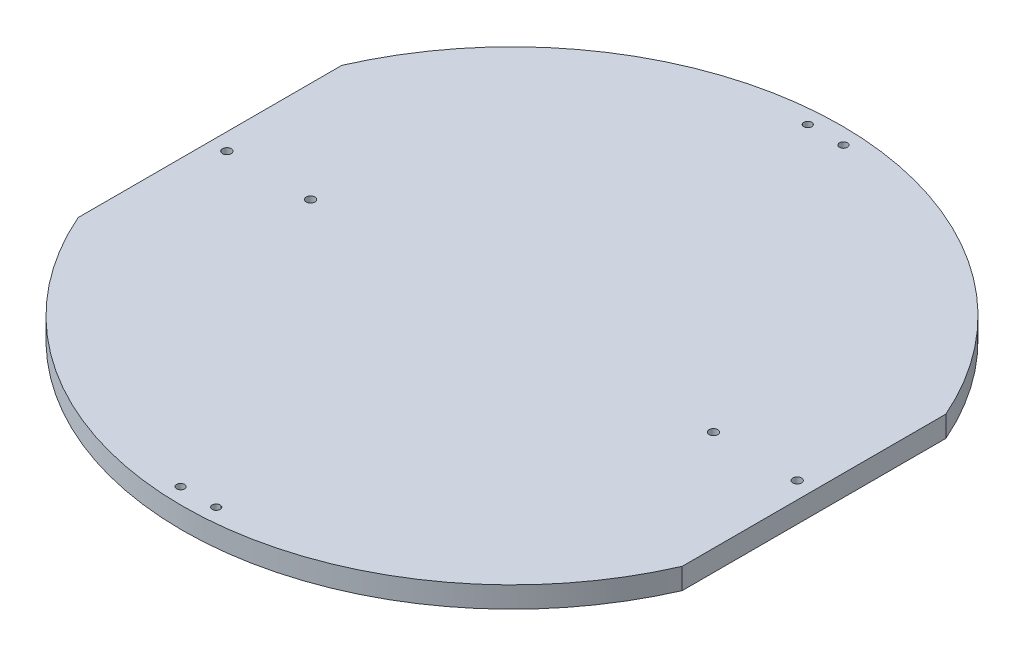
ISO-10303-21;
HEADER;
FILE_DESCRIPTION(('STEP AP214'),'2;1');
FILE_NAME('part.step','',(''),(''),'','','');
FILE_SCHEMA(('AUTOMOTIVE_DESIGN { 1 0 10303 214 1 1 1 1 }'));
ENDSEC;
DATA;
#1=APPLICATION_CONTEXT('core data for automotive mechanical design processes');
#2=APPLICATION_PROTOCOL_DEFINITION('international standard','automotive_design',2000,#1);
#3=PRODUCT_CONTEXT('',#1,'mechanical');
#4=PRODUCT('Part','Part','',(#3));
#5=PRODUCT_RELATED_PRODUCT_CATEGORY('part','',(#4));
#6=PRODUCT_DEFINITION_FORMATION('','',#4);
#7=PRODUCT_DEFINITION_CONTEXT('part definition',#1,'design');
#8=PRODUCT_DEFINITION('design','',#6,#7);
#9=PRODUCT_DEFINITION_SHAPE('','',#8);
#10=(LENGTH_UNIT() NAMED_UNIT(*) SI_UNIT(.MILLI.,.METRE.));
#11=(NAMED_UNIT(*) PLANE_ANGLE_UNIT() SI_UNIT($,.RADIAN.));
#12=(NAMED_UNIT(*) SI_UNIT($,.STERADIAN.) SOLID_ANGLE_UNIT());
#13=UNCERTAINTY_MEASURE_WITH_UNIT(LENGTH_MEASURE(1.E-05),#10,'distance_accuracy_value','');
#14=(GEOMETRIC_REPRESENTATION_CONTEXT(3) GLOBAL_UNCERTAINTY_ASSIGNED_CONTEXT((#13)) GLOBAL_UNIT_ASSIGNED_CONTEXT((#10,
#11,#12)) REPRESENTATION_CONTEXT('',''));
#15=CARTESIAN_POINT('',(0.,0.,0.));
#16=DIRECTION('',(0.,0.,1.));
#17=DIRECTION('',(1.,0.,0.));
#18=AXIS2_PLACEMENT_3D('',#15,#16,#17);
#19=CARTESIAN_POINT('',(0.,8.,0.));
#20=DIRECTION('',(0.,1.,0.));
#21=DIRECTION('',(0.,0.,1.));
#22=AXIS2_PLACEMENT_3D('',#19,#20,#21);
#23=PLANE('',#22);
#24=CARTESIAN_POINT('',(6.75000000000007,8.,118.95));
#25=DIRECTION('',(0.,1.,0.));
#26=DIRECTION('',(0.,0.,1.));
#27=AXIS2_PLACEMENT_3D('',#24,#25,#26);
#28=CIRCLE('',#27,1.5);
#29=CARTESIAN_POINT('',(6.75000000000007,8.,120.45));
#30=VERTEX_POINT('',#29);
#31=EDGE_CURVE('E145',#30,#30,#28,.T.);
#32=ORIENTED_EDGE('',*,*,#31,.F.);
#33=EDGE_LOOP('',(#32));
#34=FACE_BOUND('',#33,.T.);
#35=CARTESIAN_POINT('',(-6.75000000000005,8.,-118.95));
#36=DIRECTION('',(0.,1.,0.));
#37=DIRECTION('',(0.,0.,1.));
#38=AXIS2_PLACEMENT_3D('',#35,#36,#37);
#39=CIRCLE('',#38,1.5);
#40=CARTESIAN_POINT('',(-6.75000000000005,8.,-117.45));
#41=VERTEX_POINT('',#40);
#42=EDGE_CURVE('E133',#41,#41,#39,.T.);
#43=ORIENTED_EDGE('',*,*,#42,.F.);
#44=EDGE_LOOP('',(#43));
#45=FACE_BOUND('',#44,.T.);
#46=CARTESIAN_POINT('',(-108.164392373896,8.,0.));
#47=DIRECTION('',(0.,1.,0.));
#48=DIRECTION('',(0.,0.,-1.));
#49=AXIS2_PLACEMENT_3D('',#46,#47,#48);
#50=CIRCLE('',#49,1.65);
#51=CARTESIAN_POINT('',(-108.164392373896,8.,-1.65));
#52=VERTEX_POINT('',#51);
#53=EDGE_CURVE('E121',#52,#52,#50,.T.);
#54=ORIENTED_EDGE('',*,*,#53,.F.);
#55=EDGE_LOOP('',(#54));
#56=FACE_BOUND('',#55,.T.);
#57=CARTESIAN_POINT('',(108.164392373896,8.,0.));
#58=DIRECTION('',(0.,1.,0.));
#59=DIRECTION('',(0.,0.,1.));
#60=AXIS2_PLACEMENT_3D('',#57,#58,#59);
#61=CIRCLE('',#60,1.65);
#62=CARTESIAN_POINT('',(108.164392373896,8.,1.65));
#63=VERTEX_POINT('',#62);
#64=EDGE_CURVE('E100',#63,#63,#61,.T.);
#65=ORIENTED_EDGE('',*,*,#64,.F.);
#66=EDGE_LOOP('',(#65));
#67=FACE_BOUND('',#66,.T.);
#68=CARTESIAN_POINT('',(0.,8.,0.));
#69=DIRECTION('',(0.,1.,0.));
#70=DIRECTION('',(0.,0.,1.));
#71=AXIS2_PLACEMENT_3D('',#68,#69,#70);
#72=CIRCLE('',#71,125.);
#73=CARTESIAN_POINT('',(114.564392373896,8.,-50.));
#74=VERTEX_POINT('',#73);
#75=CARTESIAN_POINT('',(-114.564392373896,8.,-50.));
#76=VERTEX_POINT('',#75);
#77=EDGE_CURVE('E85',#74,#76,#72,.T.);
#78=ORIENTED_EDGE('',*,*,#77,.T.);
#79=DIRECTION('',(0.,0.,1.));
#80=VECTOR('',#79,1.);
#81=CARTESIAN_POINT('',(-114.564392373896,8.,50.));
#82=LINE('',#81,#80);
#83=CARTESIAN_POINT('',(-114.564392373896,8.,50.));
#84=VERTEX_POINT('',#83);
#85=EDGE_CURVE('E80',#76,#84,#82,.T.);
#86=ORIENTED_EDGE('',*,*,#85,.T.);
#87=CARTESIAN_POINT('',(0.,8.,0.));
#88=DIRECTION('',(0.,1.,0.));
#89=DIRECTION('',(0.,0.,1.));
#90=AXIS2_PLACEMENT_3D('',#87,#88,#89);
#91=CIRCLE('',#90,125.);
#92=CARTESIAN_POINT('',(114.564392373896,8.,50.));
#93=VERTEX_POINT('',#92);
#94=EDGE_CURVE('E83',#84,#93,#91,.T.);
#95=ORIENTED_EDGE('',*,*,#94,.T.);
#96=DIRECTION('',(0.,0.,-1.));
#97=VECTOR('',#96,1.);
#98=CARTESIAN_POINT('',(114.564392373896,8.,50.));
#99=LINE('',#98,#97);
#100=EDGE_CURVE('E50',#93,#74,#99,.T.);
#101=ORIENTED_EDGE('',*,*,#100,.T.);
#102=EDGE_LOOP('',(#78,#86,#95,#101));
#103=FACE_BOUND('',#102,.T.);
#104=CARTESIAN_POINT('',(76.414392373896,8.,0.));
#105=DIRECTION('',(0.,1.,0.));
#106=DIRECTION('',(0.,0.,1.));
#107=AXIS2_PLACEMENT_3D('',#104,#105,#106);
#108=CIRCLE('',#107,1.65);
#109=CARTESIAN_POINT('',(76.414392373896,8.,1.65));
#110=VERTEX_POINT('',#109);
#111=EDGE_CURVE('E115',#110,#110,#108,.T.);
#112=ORIENTED_EDGE('',*,*,#111,.F.);
#113=EDGE_LOOP('',(#112));
#114=FACE_BOUND('',#113,.T.);
#115=CARTESIAN_POINT('',(-76.414392373896,8.,0.));
#116=DIRECTION('',(0.,1.,0.));
#117=DIRECTION('',(0.,0.,-1.));
#118=AXIS2_PLACEMENT_3D('',#115,#116,#117);
#119=CIRCLE('',#118,1.65);
#120=CARTESIAN_POINT('',(-76.414392373896,8.,-1.65));
#121=VERTEX_POINT('',#120);
#122=EDGE_CURVE('E127',#121,#121,#119,.T.);
#123=ORIENTED_EDGE('',*,*,#122,.F.);
#124=EDGE_LOOP('',(#123));
#125=FACE_BOUND('',#124,.T.);
#126=CARTESIAN_POINT('',(6.75000000000007,8.,-118.95));
#127=DIRECTION('',(0.,1.,0.));
#128=DIRECTION('',(0.,0.,-1.));
#129=AXIS2_PLACEMENT_3D('',#126,#127,#128);
#130=CIRCLE('',#129,1.5);
#131=CARTESIAN_POINT('',(6.75000000000007,8.,-120.45));
#132=VERTEX_POINT('',#131);
#133=EDGE_CURVE('E139',#132,#132,#130,.T.);
#134=ORIENTED_EDGE('',*,*,#133,.F.);
#135=EDGE_LOOP('',(#134));
#136=FACE_BOUND('',#135,.T.);
#137=CARTESIAN_POINT('',(-6.75000000000005,8.,118.95));
#138=DIRECTION('',(0.,1.,0.));
#139=DIRECTION('',(0.,0.,-1.));
#140=AXIS2_PLACEMENT_3D('',#137,#138,#139);
#141=CIRCLE('',#140,1.5);
#142=CARTESIAN_POINT('',(-6.75000000000005,8.,117.45));
#143=VERTEX_POINT('',#142);
#144=EDGE_CURVE('E151',#143,#143,#141,.T.);
#145=ORIENTED_EDGE('',*,*,#144,.F.);
#146=EDGE_LOOP('',(#145));
#147=FACE_BOUND('',#146,.T.);
#148=ADVANCED_FACE('F33',(#34,#45,#56,#67,#103,#114,#125,#136,#147),#23,.T.);
#149=CARTESIAN_POINT('',(0.,0.,0.));
#150=DIRECTION('',(0.,1.,0.));
#151=DIRECTION('',(0.,0.,1.));
#152=AXIS2_PLACEMENT_3D('',#149,#150,#151);
#153=PLANE('',#152);
#154=CARTESIAN_POINT('',(0.,0.,0.));
#155=DIRECTION('',(0.,1.,0.));
#156=DIRECTION('',(0.,0.,1.));
#157=AXIS2_PLACEMENT_3D('',#154,#155,#156);
#158=CIRCLE('',#157,125.);
#159=CARTESIAN_POINT('',(114.564392373896,0.,-50.));
#160=VERTEX_POINT('',#159);
#161=CARTESIAN_POINT('',(-114.564392373896,0.,-50.));
#162=VERTEX_POINT('',#161);
#163=EDGE_CURVE('E97',#160,#162,#158,.T.);
#164=ORIENTED_EDGE('',*,*,#163,.F.);
#165=DIRECTION('',(0.,0.,-1.));
#166=VECTOR('',#165,1.);
#167=CARTESIAN_POINT('',(114.564392373896,0.,50.));
#168=LINE('',#167,#166);
#169=CARTESIAN_POINT('',(114.564392373896,0.,50.));
#170=VERTEX_POINT('',#169);
#171=EDGE_CURVE('E73',#170,#160,#168,.T.);
#172=ORIENTED_EDGE('',*,*,#171,.F.);
#173=CARTESIAN_POINT('',(0.,0.,0.));
#174=DIRECTION('',(0.,1.,0.));
#175=DIRECTION('',(0.,0.,1.));
#176=AXIS2_PLACEMENT_3D('',#173,#174,#175);
#177=CIRCLE('',#176,125.);
#178=CARTESIAN_POINT('',(-114.564392373896,0.,50.));
#179=VERTEX_POINT('',#178);
#180=EDGE_CURVE('E67',#179,#170,#177,.T.);
#181=ORIENTED_EDGE('',*,*,#180,.F.);
#182=DIRECTION('',(0.,0.,1.));
#183=VECTOR('',#182,1.);
#184=CARTESIAN_POINT('',(-114.564392373896,0.,50.));
#185=LINE('',#184,#183);
#186=EDGE_CURVE('E89',#162,#179,#185,.T.);
#187=ORIENTED_EDGE('',*,*,#186,.F.);
#188=EDGE_LOOP('',(#164,#172,#181,#187));
#189=FACE_BOUND('',#188,.T.);
#190=CARTESIAN_POINT('',(108.164392373896,0.,0.));
#191=DIRECTION('',(0.,1.,0.));
#192=DIRECTION('',(0.,0.,1.));
#193=AXIS2_PLACEMENT_3D('',#190,#191,#192);
#194=CIRCLE('',#193,1.65);
#195=CARTESIAN_POINT('',(108.164392373896,0.,1.65));
#196=VERTEX_POINT('',#195);
#197=EDGE_CURVE('E112',#196,#196,#194,.T.);
#198=ORIENTED_EDGE('',*,*,#197,.T.);
#199=EDGE_LOOP('',(#198));
#200=FACE_BOUND('',#199,.T.);
#201=CARTESIAN_POINT('',(76.414392373896,0.,0.));
#202=DIRECTION('',(0.,1.,0.));
#203=DIRECTION('',(0.,0.,1.));
#204=AXIS2_PLACEMENT_3D('',#201,#202,#203);
#205=CIRCLE('',#204,1.65);
#206=CARTESIAN_POINT('',(76.414392373896,0.,1.65));
#207=VERTEX_POINT('',#206);
#208=EDGE_CURVE('E118',#207,#207,#205,.T.);
#209=ORIENTED_EDGE('',*,*,#208,.T.);
#210=EDGE_LOOP('',(#209));
#211=FACE_BOUND('',#210,.T.);
#212=CARTESIAN_POINT('',(-108.164392373896,0.,0.));
#213=DIRECTION('',(0.,1.,0.));
#214=DIRECTION('',(0.,0.,-1.));
#215=AXIS2_PLACEMENT_3D('',#212,#213,#214);
#216=CIRCLE('',#215,1.65);
#217=CARTESIAN_POINT('',(-108.164392373896,0.,-1.65));
#218=VERTEX_POINT('',#217);
#219=EDGE_CURVE('E124',#218,#218,#216,.T.);
#220=ORIENTED_EDGE('',*,*,#219,.T.);
#221=EDGE_LOOP('',(#220));
#222=FACE_BOUND('',#221,.T.);
#223=CARTESIAN_POINT('',(-76.414392373896,0.,0.));
#224=DIRECTION('',(0.,1.,0.));
#225=DIRECTION('',(0.,0.,-1.));
#226=AXIS2_PLACEMENT_3D('',#223,#224,#225);
#227=CIRCLE('',#226,1.65);
#228=CARTESIAN_POINT('',(-76.414392373896,0.,-1.65));
#229=VERTEX_POINT('',#228);
#230=EDGE_CURVE('E130',#229,#229,#227,.T.);
#231=ORIENTED_EDGE('',*,*,#230,.T.);
#232=EDGE_LOOP('',(#231));
#233=FACE_BOUND('',#232,.T.);
#234=CARTESIAN_POINT('',(-6.75000000000005,0.,-118.95));
#235=DIRECTION('',(0.,1.,0.));
#236=DIRECTION('',(0.,0.,1.));
#237=AXIS2_PLACEMENT_3D('',#234,#235,#236);
#238=CIRCLE('',#237,1.5);
#239=CARTESIAN_POINT('',(-6.75000000000005,0.,-117.45));
#240=VERTEX_POINT('',#239);
#241=EDGE_CURVE('E136',#240,#240,#238,.T.);
#242=ORIENTED_EDGE('',*,*,#241,.T.);
#243=EDGE_LOOP('',(#242));
#244=FACE_BOUND('',#243,.T.);
#245=CARTESIAN_POINT('',(6.75000000000007,0.,-118.95));
#246=DIRECTION('',(0.,1.,0.));
#247=DIRECTION('',(0.,0.,-1.));
#248=AXIS2_PLACEMENT_3D('',#245,#246,#247);
#249=CIRCLE('',#248,1.5);
#250=CARTESIAN_POINT('',(6.75000000000007,0.,-120.45));
#251=VERTEX_POINT('',#250);
#252=EDGE_CURVE('E142',#251,#251,#249,.T.);
#253=ORIENTED_EDGE('',*,*,#252,.T.);
#254=EDGE_LOOP('',(#253));
#255=FACE_BOUND('',#254,.T.);
#256=CARTESIAN_POINT('',(6.75000000000007,0.,118.95));
#257=DIRECTION('',(0.,1.,0.));
#258=DIRECTION('',(0.,0.,1.));
#259=AXIS2_PLACEMENT_3D('',#256,#257,#258);
#260=CIRCLE('',#259,1.5);
#261=CARTESIAN_POINT('',(6.75000000000007,0.,120.45));
#262=VERTEX_POINT('',#261);
#263=EDGE_CURVE('E148',#262,#262,#260,.T.);
#264=ORIENTED_EDGE('',*,*,#263,.T.);
#265=EDGE_LOOP('',(#264));
#266=FACE_BOUND('',#265,.T.);
#267=CARTESIAN_POINT('',(-6.75000000000005,0.,118.95));
#268=DIRECTION('',(0.,1.,0.));
#269=DIRECTION('',(0.,0.,-1.));
#270=AXIS2_PLACEMENT_3D('',#267,#268,#269);
#271=CIRCLE('',#270,1.5);
#272=CARTESIAN_POINT('',(-6.75000000000005,0.,117.45));
#273=VERTEX_POINT('',#272);
#274=EDGE_CURVE('E154',#273,#273,#271,.T.);
#275=ORIENTED_EDGE('',*,*,#274,.T.);
#276=EDGE_LOOP('',(#275));
#277=FACE_BOUND('',#276,.T.);
#278=ADVANCED_FACE('F108',(#189,#200,#211,#222,#233,#244,#255,#266,#277),#153,.F.);
#279=CARTESIAN_POINT('',(0.,8.,0.));
#280=DIRECTION('',(0.,-1.,0.));
#281=DIRECTION('',(0.,0.,-1.));
#282=AXIS2_PLACEMENT_3D('',#279,#280,#281);
#283=CYLINDRICAL_SURFACE('',#282,125.);
#284=ORIENTED_EDGE('',*,*,#163,.T.);
#285=DIRECTION('',(0.,-1.,0.));
#286=VECTOR('',#285,1.);
#287=CARTESIAN_POINT('',(-114.564392373896,8.,-50.));
#288=LINE('',#287,#286);
#289=EDGE_CURVE('E11',#76,#162,#288,.T.);
#290=ORIENTED_EDGE('',*,*,#289,.F.);
#291=ORIENTED_EDGE('',*,*,#77,.F.);
#292=DIRECTION('',(0.,-1.,0.));
#293=VECTOR('',#292,1.);
#294=CARTESIAN_POINT('',(114.564392373896,8.,-50.));
#295=LINE('',#294,#293);
#296=EDGE_CURVE('E93',#74,#160,#295,.T.);
#297=ORIENTED_EDGE('',*,*,#296,.T.);
#298=EDGE_LOOP('',(#284,#290,#291,#297));
#299=FACE_BOUND('',#298,.T.);
#300=ADVANCED_FACE('F35',(#299),#283,.T.);
#301=CARTESIAN_POINT('',(-114.564392373896,8.,50.));
#302=DIRECTION('',(1.,0.,0.));
#303=DIRECTION('',(0.,0.,-1.));
#304=AXIS2_PLACEMENT_3D('',#301,#302,#303);
#305=PLANE('',#304);
#306=ORIENTED_EDGE('',*,*,#186,.T.);
#307=DIRECTION('',(0.,-1.,0.));
#308=VECTOR('',#307,1.);
#309=CARTESIAN_POINT('',(-114.564392373896,8.,50.));
#310=LINE('',#309,#308);
#311=EDGE_CURVE('E42',#84,#179,#310,.T.);
#312=ORIENTED_EDGE('',*,*,#311,.F.);
#313=ORIENTED_EDGE('',*,*,#85,.F.);
#314=ORIENTED_EDGE('',*,*,#289,.T.);
#315=EDGE_LOOP('',(#306,#312,#313,#314));
#316=FACE_BOUND('',#315,.T.);
#317=ADVANCED_FACE('F88',(#316),#305,.F.);
#318=CARTESIAN_POINT('',(0.,8.,0.));
#319=DIRECTION('',(0.,-1.,0.));
#320=DIRECTION('',(0.,0.,-1.));
#321=AXIS2_PLACEMENT_3D('',#318,#319,#320);
#322=CYLINDRICAL_SURFACE('',#321,125.);
#323=ORIENTED_EDGE('',*,*,#180,.T.);
#324=DIRECTION('',(0.,-1.,0.));
#325=VECTOR('',#324,1.);
#326=CARTESIAN_POINT('',(114.564392373896,8.,50.));
#327=LINE('',#326,#325);
#328=EDGE_CURVE('E90',#93,#170,#327,.T.);
#329=ORIENTED_EDGE('',*,*,#328,.F.);
#330=ORIENTED_EDGE('',*,*,#94,.F.);
#331=ORIENTED_EDGE('',*,*,#311,.T.);
#332=EDGE_LOOP('',(#323,#329,#330,#331));
#333=FACE_BOUND('',#332,.T.);
#334=ADVANCED_FACE('F91',(#333),#322,.T.);
#335=CARTESIAN_POINT('',(114.564392373896,8.,50.));
#336=DIRECTION('',(-1.,0.,0.));
#337=DIRECTION('',(0.,0.,1.));
#338=AXIS2_PLACEMENT_3D('',#335,#336,#337);
#339=PLANE('',#338);
#340=ORIENTED_EDGE('',*,*,#171,.T.);
#341=ORIENTED_EDGE('',*,*,#296,.F.);
#342=ORIENTED_EDGE('',*,*,#100,.F.);
#343=ORIENTED_EDGE('',*,*,#328,.T.);
#344=EDGE_LOOP('',(#340,#341,#342,#343));
#345=FACE_BOUND('',#344,.T.);
#346=ADVANCED_FACE('F105',(#345),#339,.F.);
#347=CARTESIAN_POINT('',(108.164392373896,8.,0.));
#348=DIRECTION('',(0.,-1.,0.));
#349=DIRECTION('',(0.,0.,-1.));
#350=AXIS2_PLACEMENT_3D('',#347,#348,#349);
#351=CYLINDRICAL_SURFACE('',#350,1.65);
#352=ORIENTED_EDGE('',*,*,#64,.T.);
#353=EDGE_LOOP('',(#352));
#354=FACE_BOUND('',#353,.T.);
#355=ORIENTED_EDGE('',*,*,#197,.F.);
#356=EDGE_LOOP('',(#355));
#357=FACE_BOUND('',#356,.T.);
#358=ADVANCED_FACE('F173',(#354,#357),#351,.F.);
#359=CARTESIAN_POINT('',(76.414392373896,8.,0.));
#360=DIRECTION('',(0.,-1.,0.));
#361=DIRECTION('',(0.,0.,-1.));
#362=AXIS2_PLACEMENT_3D('',#359,#360,#361);
#363=CYLINDRICAL_SURFACE('',#362,1.65);
#364=ORIENTED_EDGE('',*,*,#111,.T.);
#365=EDGE_LOOP('',(#364));
#366=FACE_BOUND('',#365,.T.);
#367=ORIENTED_EDGE('',*,*,#208,.F.);
#368=EDGE_LOOP('',(#367));
#369=FACE_BOUND('',#368,.T.);
#370=ADVANCED_FACE('F219',(#366,#369),#363,.F.);
#371=CARTESIAN_POINT('',(-108.164392373896,8.,0.));
#372=DIRECTION('',(0.,-1.,0.));
#373=DIRECTION('',(0.,0.,-1.));
#374=AXIS2_PLACEMENT_3D('',#371,#372,#373);
#375=CYLINDRICAL_SURFACE('',#374,1.65);
#376=ORIENTED_EDGE('',*,*,#53,.T.);
#377=EDGE_LOOP('',(#376));
#378=FACE_BOUND('',#377,.T.);
#379=ORIENTED_EDGE('',*,*,#219,.F.);
#380=EDGE_LOOP('',(#379));
#381=FACE_BOUND('',#380,.T.);
#382=ADVANCED_FACE('F227',(#378,#381),#375,.F.);
#383=CARTESIAN_POINT('',(-76.414392373896,8.,0.));
#384=DIRECTION('',(0.,-1.,0.));
#385=DIRECTION('',(0.,0.,-1.));
#386=AXIS2_PLACEMENT_3D('',#383,#384,#385);
#387=CYLINDRICAL_SURFACE('',#386,1.65);
#388=ORIENTED_EDGE('',*,*,#122,.T.);
#389=EDGE_LOOP('',(#388));
#390=FACE_BOUND('',#389,.T.);
#391=ORIENTED_EDGE('',*,*,#230,.F.);
#392=EDGE_LOOP('',(#391));
#393=FACE_BOUND('',#392,.T.);
#394=ADVANCED_FACE('F235',(#390,#393),#387,.F.);
#395=CARTESIAN_POINT('',(-6.75000000000005,8.,-118.95));
#396=DIRECTION('',(0.,-1.,0.));
#397=DIRECTION('',(0.,0.,-1.));
#398=AXIS2_PLACEMENT_3D('',#395,#396,#397);
#399=CYLINDRICAL_SURFACE('',#398,1.5);
#400=ORIENTED_EDGE('',*,*,#42,.T.);
#401=EDGE_LOOP('',(#400));
#402=FACE_BOUND('',#401,.T.);
#403=ORIENTED_EDGE('',*,*,#241,.F.);
#404=EDGE_LOOP('',(#403));
#405=FACE_BOUND('',#404,.T.);
#406=ADVANCED_FACE('F244',(#402,#405),#399,.F.);
#407=CARTESIAN_POINT('',(6.75000000000007,8.,-118.95));
#408=DIRECTION('',(0.,-1.,0.));
#409=DIRECTION('',(0.,0.,-1.));
#410=AXIS2_PLACEMENT_3D('',#407,#408,#409);
#411=CYLINDRICAL_SURFACE('',#410,1.5);
#412=ORIENTED_EDGE('',*,*,#133,.T.);
#413=EDGE_LOOP('',(#412));
#414=FACE_BOUND('',#413,.T.);
#415=ORIENTED_EDGE('',*,*,#252,.F.);
#416=EDGE_LOOP('',(#415));
#417=FACE_BOUND('',#416,.T.);
#418=ADVANCED_FACE('F253',(#414,#417),#411,.F.);
#419=CARTESIAN_POINT('',(6.75000000000007,8.,118.95));
#420=DIRECTION('',(0.,-1.,0.));
#421=DIRECTION('',(0.,0.,-1.));
#422=AXIS2_PLACEMENT_3D('',#419,#420,#421);
#423=CYLINDRICAL_SURFACE('',#422,1.5);
#424=ORIENTED_EDGE('',*,*,#31,.T.);
#425=EDGE_LOOP('',(#424));
#426=FACE_BOUND('',#425,.T.);
#427=ORIENTED_EDGE('',*,*,#263,.F.);
#428=EDGE_LOOP('',(#427));
#429=FACE_BOUND('',#428,.T.);
#430=ADVANCED_FACE('F262',(#426,#429),#423,.F.);
#431=CARTESIAN_POINT('',(-6.75000000000005,8.,118.95));
#432=DIRECTION('',(0.,-1.,0.));
#433=DIRECTION('',(0.,0.,-1.));
#434=AXIS2_PLACEMENT_3D('',#431,#432,#433);
#435=CYLINDRICAL_SURFACE('',#434,1.5);
#436=ORIENTED_EDGE('',*,*,#144,.T.);
#437=EDGE_LOOP('',(#436));
#438=FACE_BOUND('',#437,.T.);
#439=ORIENTED_EDGE('',*,*,#274,.F.);
#440=EDGE_LOOP('',(#439));
#441=FACE_BOUND('',#440,.T.);
#442=ADVANCED_FACE('F160',(#438,#441),#435,.F.);
#443=CLOSED_SHELL('',(#148,#278,#300,#317,#334,#346,#358,#370,#382,#394,#406,#418,#430,#442));
#444=MANIFOLD_SOLID_BREP('B2',#443);
#445=ADVANCED_BREP_SHAPE_REPRESENTATION('',(#18,#444),#14);
#446=SHAPE_DEFINITION_REPRESENTATION(#9,#445);
ENDSEC;
END-ISO-10303-21;
